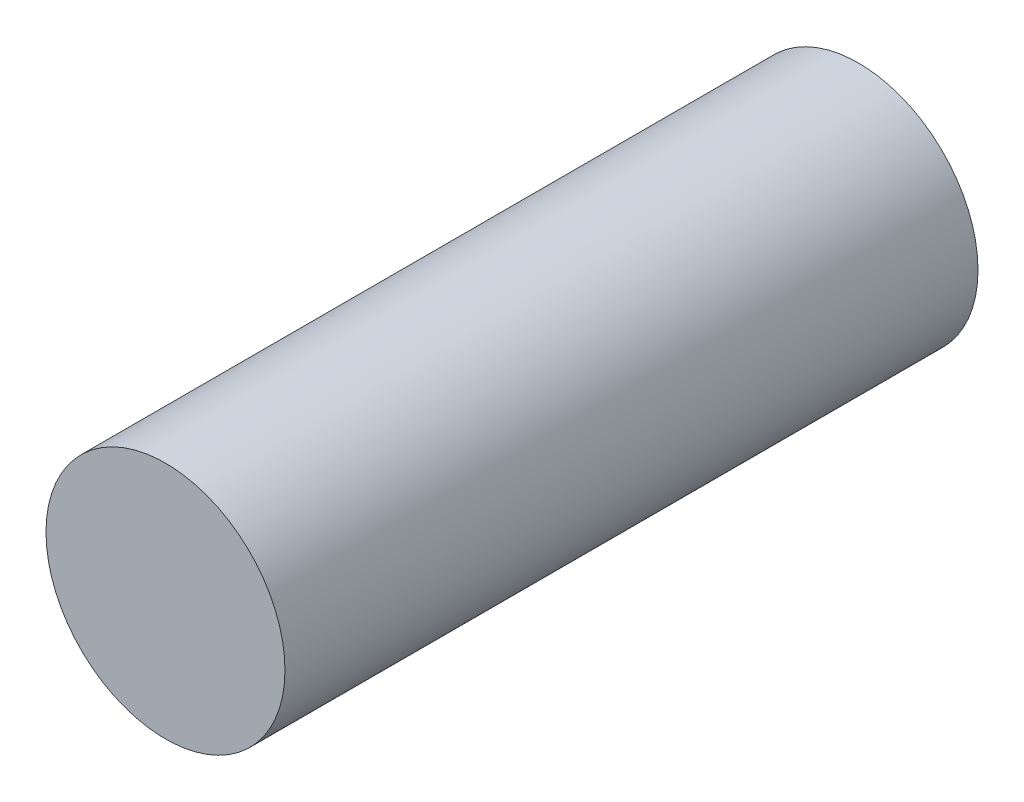
ISO-10303-21;
HEADER;
FILE_DESCRIPTION(('STEP AP214'),'2;1');
FILE_NAME('part.step','',(''),(''),'','','');
FILE_SCHEMA(('AUTOMOTIVE_DESIGN { 1 0 10303 214 1 1 1 1 }'));
ENDSEC;
DATA;
#1=APPLICATION_CONTEXT('core data for automotive mechanical design processes');
#2=APPLICATION_PROTOCOL_DEFINITION('international standard','automotive_design',2000,#1);
#3=PRODUCT_CONTEXT('',#1,'mechanical');
#4=PRODUCT('Part','Part','',(#3));
#5=PRODUCT_RELATED_PRODUCT_CATEGORY('part','',(#4));
#6=PRODUCT_DEFINITION_FORMATION('','',#4);
#7=PRODUCT_DEFINITION_CONTEXT('part definition',#1,'design');
#8=PRODUCT_DEFINITION('design','',#6,#7);
#9=PRODUCT_DEFINITION_SHAPE('','',#8);
#10=(LENGTH_UNIT() NAMED_UNIT(*) SI_UNIT(.MILLI.,.METRE.));
#11=(NAMED_UNIT(*) PLANE_ANGLE_UNIT() SI_UNIT($,.RADIAN.));
#12=(NAMED_UNIT(*) SI_UNIT($,.STERADIAN.) SOLID_ANGLE_UNIT());
#13=UNCERTAINTY_MEASURE_WITH_UNIT(LENGTH_MEASURE(1.E-05),#10,'distance_accuracy_value','');
#14=(GEOMETRIC_REPRESENTATION_CONTEXT(3) GLOBAL_UNCERTAINTY_ASSIGNED_CONTEXT((#13)) GLOBAL_UNIT_ASSIGNED_CONTEXT((#10,
#11,#12)) REPRESENTATION_CONTEXT('',''));
#15=CARTESIAN_POINT('',(0.,0.,0.));
#16=DIRECTION('',(0.,0.,1.));
#17=DIRECTION('',(1.,0.,0.));
#18=AXIS2_PLACEMENT_3D('',#15,#16,#17);
#19=CARTESIAN_POINT('',(0.,0.,14.5));
#20=DIRECTION('',(0.,0.,-1.));
#21=DIRECTION('',(-1.,0.,0.));
#22=AXIS2_PLACEMENT_3D('',#19,#20,#21);
#23=CYLINDRICAL_SURFACE('',#22,2.5);
#24=CARTESIAN_POINT('',(0.,0.,14.5));
#25=DIRECTION('',(0.,0.,1.));
#26=DIRECTION('',(1.,0.,0.));
#27=AXIS2_PLACEMENT_3D('',#24,#25,#26);
#28=CIRCLE('',#27,2.5);
#29=CARTESIAN_POINT('',(2.5,0.,14.5));
#30=VERTEX_POINT('',#29);
#31=EDGE_CURVE('E10',#30,#30,#28,.T.);
#32=ORIENTED_EDGE('',*,*,#31,.F.);
#33=EDGE_LOOP('',(#32));
#34=FACE_BOUND('',#33,.T.);
#35=CARTESIAN_POINT('',(0.,0.,0.));
#36=DIRECTION('',(0.,0.,1.));
#37=DIRECTION('',(1.,0.,0.));
#38=AXIS2_PLACEMENT_3D('',#35,#36,#37);
#39=CIRCLE('',#38,2.5);
#40=CARTESIAN_POINT('',(2.5,0.,0.));
#41=VERTEX_POINT('',#40);
#42=EDGE_CURVE('E40',#41,#41,#39,.T.);
#43=ORIENTED_EDGE('',*,*,#42,.T.);
#44=EDGE_LOOP('',(#43));
#45=FACE_BOUND('',#44,.T.);
#46=ADVANCED_FACE('F37',(#34,#45),#23,.T.);
#47=CARTESIAN_POINT('',(0.,0.,14.5));
#48=DIRECTION('',(0.,0.,1.));
#49=DIRECTION('',(1.,0.,0.));
#50=AXIS2_PLACEMENT_3D('',#47,#48,#49);
#51=PLANE('',#50);
#52=ORIENTED_EDGE('',*,*,#31,.T.);
#53=EDGE_LOOP('',(#52));
#54=FACE_BOUND('',#53,.T.);
#55=ADVANCED_FACE('F54',(#54),#51,.T.);
#56=CARTESIAN_POINT('',(0.,0.,0.));
#57=DIRECTION('',(0.,0.,1.));
#58=DIRECTION('',(1.,0.,0.));
#59=AXIS2_PLACEMENT_3D('',#56,#57,#58);
#60=PLANE('',#59);
#61=ORIENTED_EDGE('',*,*,#42,.F.);
#62=EDGE_LOOP('',(#61));
#63=FACE_BOUND('',#62,.T.);
#64=ADVANCED_FACE('F52',(#63),#60,.F.);
#65=CLOSED_SHELL('',(#46,#55,#64));
#66=MANIFOLD_SOLID_BREP('B2',#65);
#67=ADVANCED_BREP_SHAPE_REPRESENTATION('',(#18,#66),#14);
#68=SHAPE_DEFINITION_REPRESENTATION(#9,#67);
ENDSEC;
END-ISO-10303-21;
